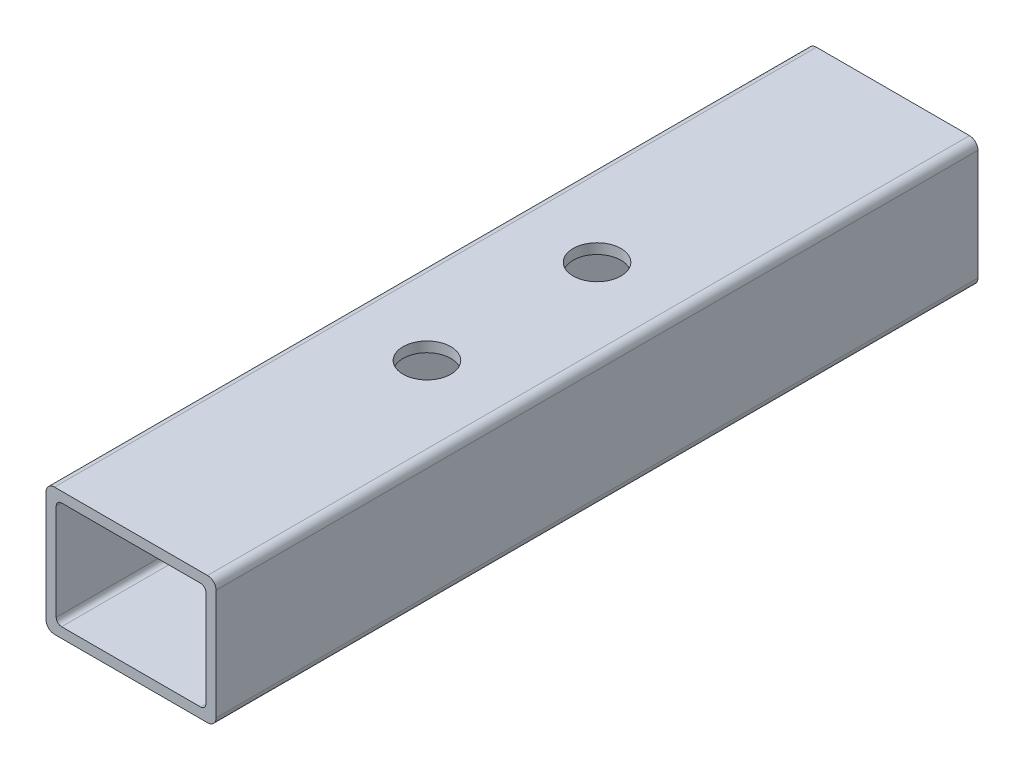
ISO-10303-21;
HEADER;
FILE_DESCRIPTION(('STEP AP214'),'2;1');
FILE_NAME('part.step','',(''),(''),'','','');
FILE_SCHEMA(('AUTOMOTIVE_DESIGN { 1 0 10303 214 1 1 1 1 }'));
ENDSEC;
DATA;
#1=APPLICATION_CONTEXT('core data for automotive mechanical design processes');
#2=APPLICATION_PROTOCOL_DEFINITION('international standard','automotive_design',2000,#1);
#3=PRODUCT_CONTEXT('',#1,'mechanical');
#4=PRODUCT('Part','Part','',(#3));
#5=PRODUCT_RELATED_PRODUCT_CATEGORY('part','',(#4));
#6=PRODUCT_DEFINITION_FORMATION('','',#4);
#7=PRODUCT_DEFINITION_CONTEXT('part definition',#1,'design');
#8=PRODUCT_DEFINITION('design','',#6,#7);
#9=PRODUCT_DEFINITION_SHAPE('','',#8);
#10=(LENGTH_UNIT() NAMED_UNIT(*) SI_UNIT(.MILLI.,.METRE.));
#11=(NAMED_UNIT(*) PLANE_ANGLE_UNIT() SI_UNIT($,.RADIAN.));
#12=(NAMED_UNIT(*) SI_UNIT($,.STERADIAN.) SOLID_ANGLE_UNIT());
#13=UNCERTAINTY_MEASURE_WITH_UNIT(LENGTH_MEASURE(1.E-05),#10,'distance_accuracy_value','');
#14=(GEOMETRIC_REPRESENTATION_CONTEXT(3) GLOBAL_UNCERTAINTY_ASSIGNED_CONTEXT((#13)) GLOBAL_UNIT_ASSIGNED_CONTEXT((#10,
#11,#12)) REPRESENTATION_CONTEXT('',''));
#15=CARTESIAN_POINT('',(0.,0.,0.));
#16=DIRECTION('',(0.,0.,1.));
#17=DIRECTION('',(1.,0.,0.));
#18=AXIS2_PLACEMENT_3D('',#15,#16,#17);
#19=CARTESIAN_POINT('',(22.86,-16.51,227.56368));
#20=DIRECTION('',(0.,0.,1.));
#21=DIRECTION('',(1.,0.,0.));
#22=AXIS2_PLACEMENT_3D('',#19,#20,#21);
#23=PLANE('',#22);
#24=CARTESIAN_POINT('',(22.86,-16.51,227.56368));
#25=DIRECTION('',(0.,0.,1.));
#26=DIRECTION('',(1.,0.,0.));
#27=AXIS2_PLACEMENT_3D('',#24,#25,#26);
#28=CIRCLE('',#27,2.53999999999999);
#29=CARTESIAN_POINT('',(22.86,-19.05,227.56368));
#30=VERTEX_POINT('',#29);
#31=CARTESIAN_POINT('',(25.4,-16.51,227.56368));
#32=VERTEX_POINT('',#31);
#33=EDGE_CURVE('E246',#30,#32,#28,.T.);
#34=ORIENTED_EDGE('',*,*,#33,.T.);
#35=DIRECTION('',(0.,1.,0.));
#36=VECTOR('',#35,1.);
#37=CARTESIAN_POINT('',(25.4,-16.51,227.56368));
#38=LINE('',#37,#36);
#39=CARTESIAN_POINT('',(25.4,16.51,227.56368));
#40=VERTEX_POINT('',#39);
#41=EDGE_CURVE('E250',#32,#40,#38,.T.);
#42=ORIENTED_EDGE('',*,*,#41,.T.);
#43=CARTESIAN_POINT('',(22.86,16.51,227.56368));
#44=DIRECTION('',(0.,0.,1.));
#45=DIRECTION('',(1.,0.,0.));
#46=AXIS2_PLACEMENT_3D('',#43,#44,#45);
#47=CIRCLE('',#46,2.54);
#48=CARTESIAN_POINT('',(22.86,19.05,227.56368));
#49=VERTEX_POINT('',#48);
#50=EDGE_CURVE('E254',#40,#49,#47,.T.);
#51=ORIENTED_EDGE('',*,*,#50,.T.);
#52=DIRECTION('',(-1.,0.,0.));
#53=VECTOR('',#52,1.);
#54=CARTESIAN_POINT('',(22.86,19.05,227.56368));
#55=LINE('',#54,#53);
#56=CARTESIAN_POINT('',(-22.86,19.05,227.56368));
#57=VERTEX_POINT('',#56);
#58=EDGE_CURVE('E257',#49,#57,#55,.T.);
#59=ORIENTED_EDGE('',*,*,#58,.T.);
#60=CARTESIAN_POINT('',(-22.86,16.51,227.56368));
#61=DIRECTION('',(0.,0.,1.));
#62=DIRECTION('',(1.,0.,0.));
#63=AXIS2_PLACEMENT_3D('',#60,#61,#62);
#64=CIRCLE('',#63,2.54);
#65=CARTESIAN_POINT('',(-25.4,16.51,227.56368));
#66=VERTEX_POINT('',#65);
#67=EDGE_CURVE('E260',#57,#66,#64,.T.);
#68=ORIENTED_EDGE('',*,*,#67,.T.);
#69=DIRECTION('',(0.,-1.,0.));
#70=VECTOR('',#69,1.);
#71=CARTESIAN_POINT('',(-25.4,-16.51,227.56368));
#72=LINE('',#71,#70);
#73=CARTESIAN_POINT('',(-25.4,-16.51,227.56368));
#74=VERTEX_POINT('',#73);
#75=EDGE_CURVE('E263',#66,#74,#72,.T.);
#76=ORIENTED_EDGE('',*,*,#75,.T.);
#77=CARTESIAN_POINT('',(-22.86,-16.51,227.56368));
#78=DIRECTION('',(0.,0.,1.));
#79=DIRECTION('',(1.,0.,0.));
#80=AXIS2_PLACEMENT_3D('',#77,#78,#79);
#81=CIRCLE('',#80,2.54);
#82=CARTESIAN_POINT('',(-22.86,-19.05,227.56368));
#83=VERTEX_POINT('',#82);
#84=EDGE_CURVE('E266',#74,#83,#81,.T.);
#85=ORIENTED_EDGE('',*,*,#84,.T.);
#86=DIRECTION('',(1.,0.,0.));
#87=VECTOR('',#86,1.);
#88=CARTESIAN_POINT('',(22.86,-19.05,227.56368));
#89=LINE('',#88,#87);
#90=EDGE_CURVE('E269',#83,#30,#89,.T.);
#91=ORIENTED_EDGE('',*,*,#90,.T.);
#92=EDGE_LOOP('',(#34,#42,#51,#59,#68,#76,#85,#91));
#93=FACE_BOUND('',#92,.T.);
#94=DIRECTION('',(-1.,0.,0.));
#95=VECTOR('',#94,1.);
#96=CARTESIAN_POINT('',(20.7518,16.002,227.56368));
#97=LINE('',#96,#95);
#98=CARTESIAN_POINT('',(20.7518,16.002,227.56368));
#99=VERTEX_POINT('',#98);
#100=CARTESIAN_POINT('',(-20.7518,16.002,227.56368));
#101=VERTEX_POINT('',#100);
#102=EDGE_CURVE('E164',#99,#101,#97,.T.);
#103=ORIENTED_EDGE('',*,*,#102,.F.);
#104=CARTESIAN_POINT('',(20.7518,14.4018,227.56368));
#105=DIRECTION('',(0.,0.,1.));
#106=DIRECTION('',(1.,0.,0.));
#107=AXIS2_PLACEMENT_3D('',#104,#105,#106);
#108=CIRCLE('',#107,1.6002);
#109=CARTESIAN_POINT('',(22.352,14.4018,227.56368));
#110=VERTEX_POINT('',#109);
#111=EDGE_CURVE('E155',#110,#99,#108,.T.);
#112=ORIENTED_EDGE('',*,*,#111,.F.);
#113=DIRECTION('',(0.,1.,0.));
#114=VECTOR('',#113,1.);
#115=CARTESIAN_POINT('',(22.352,14.4018,227.56368));
#116=LINE('',#115,#114);
#117=CARTESIAN_POINT('',(22.352,-14.4018,227.56368));
#118=VERTEX_POINT('',#117);
#119=EDGE_CURVE('E197',#118,#110,#116,.T.);
#120=ORIENTED_EDGE('',*,*,#119,.F.);
#121=CARTESIAN_POINT('',(20.7518,-14.4018,227.56368));
#122=DIRECTION('',(0.,0.,1.));
#123=DIRECTION('',(1.,0.,0.));
#124=AXIS2_PLACEMENT_3D('',#121,#122,#123);
#125=CIRCLE('',#124,1.6002);
#126=CARTESIAN_POINT('',(20.7518,-16.002,227.56368));
#127=VERTEX_POINT('',#126);
#128=EDGE_CURVE('E194',#127,#118,#125,.T.);
#129=ORIENTED_EDGE('',*,*,#128,.F.);
#130=DIRECTION('',(1.,0.,0.));
#131=VECTOR('',#130,1.);
#132=CARTESIAN_POINT('',(20.7518,-16.002,227.56368));
#133=LINE('',#132,#131);
#134=CARTESIAN_POINT('',(-20.7518,-16.002,227.56368));
#135=VERTEX_POINT('',#134);
#136=EDGE_CURVE('E191',#135,#127,#133,.T.);
#137=ORIENTED_EDGE('',*,*,#136,.F.);
#138=CARTESIAN_POINT('',(-20.7518,-14.4018,227.56368));
#139=DIRECTION('',(0.,0.,1.));
#140=DIRECTION('',(1.,0.,0.));
#141=AXIS2_PLACEMENT_3D('',#138,#139,#140);
#142=CIRCLE('',#141,1.6002);
#143=CARTESIAN_POINT('',(-22.352,-14.4018,227.56368));
#144=VERTEX_POINT('',#143);
#145=EDGE_CURVE('E188',#144,#135,#142,.T.);
#146=ORIENTED_EDGE('',*,*,#145,.F.);
#147=DIRECTION('',(0.,-1.,0.));
#148=VECTOR('',#147,1.);
#149=CARTESIAN_POINT('',(-22.352,14.4018,227.56368));
#150=LINE('',#149,#148);
#151=CARTESIAN_POINT('',(-22.352,14.4018,227.56368));
#152=VERTEX_POINT('',#151);
#153=EDGE_CURVE('E182',#152,#144,#150,.T.);
#154=ORIENTED_EDGE('',*,*,#153,.F.);
#155=CARTESIAN_POINT('',(-20.7518,14.4018,227.56368));
#156=DIRECTION('',(0.,0.,1.));
#157=DIRECTION('',(1.,0.,0.));
#158=AXIS2_PLACEMENT_3D('',#155,#156,#157);
#159=CIRCLE('',#158,1.6002);
#160=EDGE_CURVE('E178',#101,#152,#159,.T.);
#161=ORIENTED_EDGE('',*,*,#160,.F.);
#162=EDGE_LOOP('',(#103,#112,#120,#129,#137,#146,#154,#161));
#163=FACE_BOUND('',#162,.T.);
#164=ADVANCED_FACE('F41',(#93,#163),#23,.T.);
#165=CARTESIAN_POINT('',(22.86,-16.51,0.));
#166=DIRECTION('',(0.,0.,1.));
#167=DIRECTION('',(1.,0.,0.));
#168=AXIS2_PLACEMENT_3D('',#165,#166,#167);
#169=PLANE('',#168);
#170=CARTESIAN_POINT('',(22.86,-16.51,0.));
#171=DIRECTION('',(0.,0.,1.));
#172=DIRECTION('',(1.,0.,0.));
#173=AXIS2_PLACEMENT_3D('',#170,#171,#172);
#174=CIRCLE('',#173,2.53999999999999);
#175=CARTESIAN_POINT('',(22.86,-19.05,0.));
#176=VERTEX_POINT('',#175);
#177=CARTESIAN_POINT('',(25.4,-16.51,0.));
#178=VERTEX_POINT('',#177);
#179=EDGE_CURVE('E173',#176,#178,#174,.T.);
#180=ORIENTED_EDGE('',*,*,#179,.F.);
#181=DIRECTION('',(1.,0.,0.));
#182=VECTOR('',#181,1.);
#183=CARTESIAN_POINT('',(22.86,-19.05,0.));
#184=LINE('',#183,#182);
#185=CARTESIAN_POINT('',(-22.86,-19.05,0.));
#186=VERTEX_POINT('',#185);
#187=EDGE_CURVE('E251',#186,#176,#184,.T.);
#188=ORIENTED_EDGE('',*,*,#187,.F.);
#189=CARTESIAN_POINT('',(-22.86,-16.51,0.));
#190=DIRECTION('',(0.,0.,1.));
#191=DIRECTION('',(1.,0.,0.));
#192=AXIS2_PLACEMENT_3D('',#189,#190,#191);
#193=CIRCLE('',#192,2.54);
#194=CARTESIAN_POINT('',(-25.4,-16.51,0.));
#195=VERTEX_POINT('',#194);
#196=EDGE_CURVE('E291',#195,#186,#193,.T.);
#197=ORIENTED_EDGE('',*,*,#196,.F.);
#198=DIRECTION('',(0.,-1.,0.));
#199=VECTOR('',#198,1.);
#200=CARTESIAN_POINT('',(-25.4,-16.51,0.));
#201=LINE('',#200,#199);
#202=CARTESIAN_POINT('',(-25.4,16.51,0.));
#203=VERTEX_POINT('',#202);
#204=EDGE_CURVE('E288',#203,#195,#201,.T.);
#205=ORIENTED_EDGE('',*,*,#204,.F.);
#206=CARTESIAN_POINT('',(-22.86,16.51,0.));
#207=DIRECTION('',(0.,0.,1.));
#208=DIRECTION('',(1.,0.,0.));
#209=AXIS2_PLACEMENT_3D('',#206,#207,#208);
#210=CIRCLE('',#209,2.54);
#211=CARTESIAN_POINT('',(-22.86,19.05,0.));
#212=VERTEX_POINT('',#211);
#213=EDGE_CURVE('E285',#212,#203,#210,.T.);
#214=ORIENTED_EDGE('',*,*,#213,.F.);
#215=DIRECTION('',(-1.,0.,0.));
#216=VECTOR('',#215,1.);
#217=CARTESIAN_POINT('',(22.86,19.05,0.));
#218=LINE('',#217,#216);
#219=CARTESIAN_POINT('',(22.86,19.05,0.));
#220=VERTEX_POINT('',#219);
#221=EDGE_CURVE('E282',#220,#212,#218,.T.);
#222=ORIENTED_EDGE('',*,*,#221,.F.);
#223=CARTESIAN_POINT('',(22.86,16.51,0.));
#224=DIRECTION('',(0.,0.,1.));
#225=DIRECTION('',(1.,0.,0.));
#226=AXIS2_PLACEMENT_3D('',#223,#224,#225);
#227=CIRCLE('',#226,2.54);
#228=CARTESIAN_POINT('',(25.4,16.51,0.));
#229=VERTEX_POINT('',#228);
#230=EDGE_CURVE('E279',#229,#220,#227,.T.);
#231=ORIENTED_EDGE('',*,*,#230,.F.);
#232=DIRECTION('',(0.,1.,0.));
#233=VECTOR('',#232,1.);
#234=CARTESIAN_POINT('',(25.4,-16.51,0.));
#235=LINE('',#234,#233);
#236=EDGE_CURVE('E276',#178,#229,#235,.T.);
#237=ORIENTED_EDGE('',*,*,#236,.F.);
#238=EDGE_LOOP('',(#180,#188,#197,#205,#214,#222,#231,#237));
#239=FACE_BOUND('',#238,.T.);
#240=CARTESIAN_POINT('',(20.7518,14.4018,0.));
#241=DIRECTION('',(0.,0.,1.));
#242=DIRECTION('',(1.,0.,0.));
#243=AXIS2_PLACEMENT_3D('',#240,#241,#242);
#244=CIRCLE('',#243,1.6002);
#245=CARTESIAN_POINT('',(22.352,14.4018,0.));
#246=VERTEX_POINT('',#245);
#247=CARTESIAN_POINT('',(20.7518,16.002,0.));
#248=VERTEX_POINT('',#247);
#249=EDGE_CURVE('E65',#246,#248,#244,.T.);
#250=ORIENTED_EDGE('',*,*,#249,.T.);
#251=DIRECTION('',(-1.,0.,0.));
#252=VECTOR('',#251,1.);
#253=CARTESIAN_POINT('',(20.7518,16.002,0.));
#254=LINE('',#253,#252);
#255=CARTESIAN_POINT('',(-20.7518,16.002,0.));
#256=VERTEX_POINT('',#255);
#257=EDGE_CURVE('E171',#248,#256,#254,.T.);
#258=ORIENTED_EDGE('',*,*,#257,.T.);
#259=CARTESIAN_POINT('',(-20.7518,14.4018,0.));
#260=DIRECTION('',(0.,0.,1.));
#261=DIRECTION('',(1.,0.,0.));
#262=AXIS2_PLACEMENT_3D('',#259,#260,#261);
#263=CIRCLE('',#262,1.6002);
#264=CARTESIAN_POINT('',(-22.352,14.4018,0.));
#265=VERTEX_POINT('',#264);
#266=EDGE_CURVE('E205',#256,#265,#263,.T.);
#267=ORIENTED_EDGE('',*,*,#266,.T.);
#268=DIRECTION('',(0.,-1.,0.));
#269=VECTOR('',#268,1.);
#270=CARTESIAN_POINT('',(-22.352,14.4018,0.));
#271=LINE('',#270,#269);
#272=CARTESIAN_POINT('',(-22.352,-14.4018,0.));
#273=VERTEX_POINT('',#272);
#274=EDGE_CURVE('E209',#265,#273,#271,.T.);
#275=ORIENTED_EDGE('',*,*,#274,.T.);
#276=CARTESIAN_POINT('',(-20.7518,-14.4018,0.));
#277=DIRECTION('',(0.,0.,1.));
#278=DIRECTION('',(1.,0.,0.));
#279=AXIS2_PLACEMENT_3D('',#276,#277,#278);
#280=CIRCLE('',#279,1.6002);
#281=CARTESIAN_POINT('',(-20.7518,-16.002,0.));
#282=VERTEX_POINT('',#281);
#283=EDGE_CURVE('E213',#273,#282,#280,.T.);
#284=ORIENTED_EDGE('',*,*,#283,.T.);
#285=DIRECTION('',(1.,0.,0.));
#286=VECTOR('',#285,1.);
#287=CARTESIAN_POINT('',(20.7518,-16.002,0.));
#288=LINE('',#287,#286);
#289=CARTESIAN_POINT('',(20.7518,-16.002,0.));
#290=VERTEX_POINT('',#289);
#291=EDGE_CURVE('E217',#282,#290,#288,.T.);
#292=ORIENTED_EDGE('',*,*,#291,.T.);
#293=CARTESIAN_POINT('',(20.7518,-14.4018,0.));
#294=DIRECTION('',(0.,0.,1.));
#295=DIRECTION('',(1.,0.,0.));
#296=AXIS2_PLACEMENT_3D('',#293,#294,#295);
#297=CIRCLE('',#296,1.6002);
#298=CARTESIAN_POINT('',(22.352,-14.4018,0.));
#299=VERTEX_POINT('',#298);
#300=EDGE_CURVE('E221',#290,#299,#297,.T.);
#301=ORIENTED_EDGE('',*,*,#300,.T.);
#302=DIRECTION('',(0.,1.,0.));
#303=VECTOR('',#302,1.);
#304=CARTESIAN_POINT('',(22.352,14.4018,0.));
#305=LINE('',#304,#303);
#306=EDGE_CURVE('E165',#299,#246,#305,.T.);
#307=ORIENTED_EDGE('',*,*,#306,.T.);
#308=EDGE_LOOP('',(#250,#258,#267,#275,#284,#292,#301,#307));
#309=FACE_BOUND('',#308,.T.);
#310=ADVANCED_FACE('F330',(#239,#309),#169,.F.);
#311=CARTESIAN_POINT('',(22.86,-16.51,227.56368));
#312=DIRECTION('',(0.,0.,-1.));
#313=DIRECTION('',(-1.,0.,0.));
#314=AXIS2_PLACEMENT_3D('',#311,#312,#313);
#315=CYLINDRICAL_SURFACE('',#314,2.53999999999999);
#316=ORIENTED_EDGE('',*,*,#179,.T.);
#317=DIRECTION('',(0.,0.,-1.));
#318=VECTOR('',#317,1.);
#319=CARTESIAN_POINT('',(25.4,-16.51,227.56368));
#320=LINE('',#319,#318);
#321=EDGE_CURVE('E11',#32,#178,#320,.T.);
#322=ORIENTED_EDGE('',*,*,#321,.F.);
#323=ORIENTED_EDGE('',*,*,#33,.F.);
#324=DIRECTION('',(0.,0.,-1.));
#325=VECTOR('',#324,1.);
#326=CARTESIAN_POINT('',(22.86,-19.05,227.56368));
#327=LINE('',#326,#325);
#328=EDGE_CURVE('E272',#30,#176,#327,.T.);
#329=ORIENTED_EDGE('',*,*,#328,.T.);
#330=EDGE_LOOP('',(#316,#322,#323,#329));
#331=FACE_BOUND('',#330,.T.);
#332=ADVANCED_FACE('F43',(#331),#315,.T.);
#333=CARTESIAN_POINT('',(25.4,-16.51,227.56368));
#334=DIRECTION('',(-1.,0.,0.));
#335=DIRECTION('',(0.,0.,1.));
#336=AXIS2_PLACEMENT_3D('',#333,#334,#335);
#337=PLANE('',#336);
#338=ORIENTED_EDGE('',*,*,#236,.T.);
#339=DIRECTION('',(0.,0.,-1.));
#340=VECTOR('',#339,1.);
#341=CARTESIAN_POINT('',(25.4,16.51,227.56368));
#342=LINE('',#341,#340);
#343=EDGE_CURVE('E50',#40,#229,#342,.T.);
#344=ORIENTED_EDGE('',*,*,#343,.F.);
#345=ORIENTED_EDGE('',*,*,#41,.F.);
#346=ORIENTED_EDGE('',*,*,#321,.T.);
#347=EDGE_LOOP('',(#338,#344,#345,#346));
#348=FACE_BOUND('',#347,.T.);
#349=ADVANCED_FACE('F347',(#348),#337,.F.);
#350=CARTESIAN_POINT('',(22.86,16.51,227.56368));
#351=DIRECTION('',(0.,0.,-1.));
#352=DIRECTION('',(-1.,0.,0.));
#353=AXIS2_PLACEMENT_3D('',#350,#351,#352);
#354=CYLINDRICAL_SURFACE('',#353,2.54);
#355=ORIENTED_EDGE('',*,*,#230,.T.);
#356=DIRECTION('',(0.,0.,-1.));
#357=VECTOR('',#356,1.);
#358=CARTESIAN_POINT('',(22.86,19.05,227.56368));
#359=LINE('',#358,#357);
#360=EDGE_CURVE('E315',#49,#220,#359,.T.);
#361=ORIENTED_EDGE('',*,*,#360,.F.);
#362=ORIENTED_EDGE('',*,*,#50,.F.);
#363=ORIENTED_EDGE('',*,*,#343,.T.);
#364=EDGE_LOOP('',(#355,#361,#362,#363));
#365=FACE_BOUND('',#364,.T.);
#366=ADVANCED_FACE('F324',(#365),#354,.T.);
#367=CARTESIAN_POINT('',(22.86,19.05,227.56368));
#368=DIRECTION('',(0.,-1.,0.));
#369=DIRECTION('',(0.,0.,-1.));
#370=AXIS2_PLACEMENT_3D('',#367,#368,#369);
#371=PLANE('',#370);
#372=CARTESIAN_POINT('',(0.,19.05,139.18184));
#373=DIRECTION('',(0.,1.,0.));
#374=DIRECTION('',(0.,0.,1.));
#375=AXIS2_PLACEMENT_3D('',#372,#373,#374);
#376=CIRCLE('',#375,7.14375);
#377=CARTESIAN_POINT('',(0.,19.05,146.32559));
#378=VERTEX_POINT('',#377);
#379=EDGE_CURVE('E202',#378,#378,#376,.T.);
#380=ORIENTED_EDGE('',*,*,#379,.F.);
#381=EDGE_LOOP('',(#380));
#382=FACE_BOUND('',#381,.T.);
#383=CARTESIAN_POINT('',(0.,19.05,88.38184));
#384=DIRECTION('',(0.,1.,0.));
#385=DIRECTION('',(0.,0.,1.));
#386=AXIS2_PLACEMENT_3D('',#383,#384,#385);
#387=CIRCLE('',#386,7.14375);
#388=CARTESIAN_POINT('',(0.,19.05,95.52559));
#389=VERTEX_POINT('',#388);
#390=EDGE_CURVE('E432',#389,#389,#387,.T.);
#391=ORIENTED_EDGE('',*,*,#390,.F.);
#392=EDGE_LOOP('',(#391));
#393=FACE_BOUND('',#392,.T.);
#394=ORIENTED_EDGE('',*,*,#221,.T.);
#395=DIRECTION('',(0.,0.,-1.));
#396=VECTOR('',#395,1.);
#397=CARTESIAN_POINT('',(-22.86,19.05,227.56368));
#398=LINE('',#397,#396);
#399=EDGE_CURVE('E311',#57,#212,#398,.T.);
#400=ORIENTED_EDGE('',*,*,#399,.F.);
#401=ORIENTED_EDGE('',*,*,#58,.F.);
#402=ORIENTED_EDGE('',*,*,#360,.T.);
#403=EDGE_LOOP('',(#394,#400,#401,#402));
#404=FACE_BOUND('',#403,.T.);
#405=ADVANCED_FACE('F336',(#382,#393,#404),#371,.F.);
#406=CARTESIAN_POINT('',(-22.86,16.51,227.56368));
#407=DIRECTION('',(0.,0.,-1.));
#408=DIRECTION('',(-1.,0.,0.));
#409=AXIS2_PLACEMENT_3D('',#406,#407,#408);
#410=CYLINDRICAL_SURFACE('',#409,2.54);
#411=ORIENTED_EDGE('',*,*,#213,.T.);
#412=DIRECTION('',(0.,0.,-1.));
#413=VECTOR('',#412,1.);
#414=CARTESIAN_POINT('',(-25.4,16.51,227.56368));
#415=LINE('',#414,#413);
#416=EDGE_CURVE('E307',#66,#203,#415,.T.);
#417=ORIENTED_EDGE('',*,*,#416,.F.);
#418=ORIENTED_EDGE('',*,*,#67,.F.);
#419=ORIENTED_EDGE('',*,*,#399,.T.);
#420=EDGE_LOOP('',(#411,#417,#418,#419));
#421=FACE_BOUND('',#420,.T.);
#422=ADVANCED_FACE('F340',(#421),#410,.T.);
#423=CARTESIAN_POINT('',(-25.4,-16.51,227.56368));
#424=DIRECTION('',(1.,0.,0.));
#425=DIRECTION('',(0.,1.,0.));
#426=AXIS2_PLACEMENT_3D('',#423,#424,#425);
#427=PLANE('',#426);
#428=ORIENTED_EDGE('',*,*,#204,.T.);
#429=DIRECTION('',(0.,0.,-1.));
#430=VECTOR('',#429,1.);
#431=CARTESIAN_POINT('',(-25.4,-16.51,227.56368));
#432=LINE('',#431,#430);
#433=EDGE_CURVE('E303',#74,#195,#432,.T.);
#434=ORIENTED_EDGE('',*,*,#433,.F.);
#435=ORIENTED_EDGE('',*,*,#75,.F.);
#436=ORIENTED_EDGE('',*,*,#416,.T.);
#437=EDGE_LOOP('',(#428,#434,#435,#436));
#438=FACE_BOUND('',#437,.T.);
#439=ADVANCED_FACE('F360',(#438),#427,.F.);
#440=CARTESIAN_POINT('',(-22.86,-16.51,227.56368));
#441=DIRECTION('',(0.,0.,-1.));
#442=DIRECTION('',(-1.,0.,0.));
#443=AXIS2_PLACEMENT_3D('',#440,#441,#442);
#444=CYLINDRICAL_SURFACE('',#443,2.54);
#445=ORIENTED_EDGE('',*,*,#196,.T.);
#446=DIRECTION('',(0.,0.,-1.));
#447=VECTOR('',#446,1.);
#448=CARTESIAN_POINT('',(-22.86,-19.05,227.56368));
#449=LINE('',#448,#447);
#450=EDGE_CURVE('E299',#83,#186,#449,.T.);
#451=ORIENTED_EDGE('',*,*,#450,.F.);
#452=ORIENTED_EDGE('',*,*,#84,.F.);
#453=ORIENTED_EDGE('',*,*,#433,.T.);
#454=EDGE_LOOP('',(#445,#451,#452,#453));
#455=FACE_BOUND('',#454,.T.);
#456=ADVANCED_FACE('F358',(#455),#444,.T.);
#457=CARTESIAN_POINT('',(22.86,-19.05,227.56368));
#458=DIRECTION('',(0.,1.,0.));
#459=DIRECTION('',(-1.,0.,0.));
#460=AXIS2_PLACEMENT_3D('',#457,#458,#459);
#461=PLANE('',#460);
#462=ORIENTED_EDGE('',*,*,#187,.T.);
#463=ORIENTED_EDGE('',*,*,#328,.F.);
#464=ORIENTED_EDGE('',*,*,#90,.F.);
#465=ORIENTED_EDGE('',*,*,#450,.T.);
#466=EDGE_LOOP('',(#462,#463,#464,#465));
#467=FACE_BOUND('',#466,.T.);
#468=ADVANCED_FACE('F353',(#467),#461,.F.);
#469=CARTESIAN_POINT('',(20.7518,14.4018,227.56368));
#470=DIRECTION('',(0.,0.,-1.));
#471=DIRECTION('',(-1.,0.,0.));
#472=AXIS2_PLACEMENT_3D('',#469,#470,#471);
#473=CYLINDRICAL_SURFACE('',#472,1.6002);
#474=ORIENTED_EDGE('',*,*,#249,.F.);
#475=DIRECTION('',(0.,0.,-1.));
#476=VECTOR('',#475,1.);
#477=CARTESIAN_POINT('',(22.352,14.4018,227.56368));
#478=LINE('',#477,#476);
#479=EDGE_CURVE('E159',#110,#246,#478,.T.);
#480=ORIENTED_EDGE('',*,*,#479,.F.);
#481=ORIENTED_EDGE('',*,*,#111,.T.);
#482=DIRECTION('',(0.,0.,-1.));
#483=VECTOR('',#482,1.);
#484=CARTESIAN_POINT('',(20.7518,16.002,227.56368));
#485=LINE('',#484,#483);
#486=EDGE_CURVE('E158',#99,#248,#485,.T.);
#487=ORIENTED_EDGE('',*,*,#486,.T.);
#488=EDGE_LOOP('',(#474,#480,#481,#487));
#489=FACE_BOUND('',#488,.T.);
#490=ADVANCED_FACE('F157',(#489),#473,.F.);
#491=CARTESIAN_POINT('',(20.7518,16.002,227.56368));
#492=DIRECTION('',(0.,-1.,0.));
#493=DIRECTION('',(1.,0.,0.));
#494=AXIS2_PLACEMENT_3D('',#491,#492,#493);
#495=PLANE('',#494);
#496=CARTESIAN_POINT('',(0.,16.002,139.18184));
#497=DIRECTION('',(0.,-1.,0.));
#498=DIRECTION('',(1.,0.,0.));
#499=AXIS2_PLACEMENT_3D('',#496,#497,#498);
#500=CIRCLE('',#499,7.14375);
#501=CARTESIAN_POINT('',(7.14375,16.002,139.18184));
#502=VERTEX_POINT('',#501);
#503=EDGE_CURVE('E425',#502,#502,#500,.F.);
#504=ORIENTED_EDGE('',*,*,#503,.T.);
#505=EDGE_LOOP('',(#504));
#506=FACE_BOUND('',#505,.T.);
#507=CARTESIAN_POINT('',(0.,16.002,88.38184));
#508=DIRECTION('',(0.,-1.,0.));
#509=DIRECTION('',(1.,0.,0.));
#510=AXIS2_PLACEMENT_3D('',#507,#508,#509);
#511=CIRCLE('',#510,7.14375);
#512=CARTESIAN_POINT('',(7.14375,16.002,88.38184));
#513=VERTEX_POINT('',#512);
#514=EDGE_CURVE('E435',#513,#513,#511,.F.);
#515=ORIENTED_EDGE('',*,*,#514,.T.);
#516=EDGE_LOOP('',(#515));
#517=FACE_BOUND('',#516,.T.);
#518=ORIENTED_EDGE('',*,*,#257,.F.);
#519=ORIENTED_EDGE('',*,*,#486,.F.);
#520=ORIENTED_EDGE('',*,*,#102,.T.);
#521=DIRECTION('',(0.,0.,-1.));
#522=VECTOR('',#521,1.);
#523=CARTESIAN_POINT('',(-20.7518,16.002,227.56368));
#524=LINE('',#523,#522);
#525=EDGE_CURVE('E174',#101,#256,#524,.T.);
#526=ORIENTED_EDGE('',*,*,#525,.T.);
#527=EDGE_LOOP('',(#518,#519,#520,#526));
#528=FACE_BOUND('',#527,.T.);
#529=ADVANCED_FACE('F168',(#506,#517,#528),#495,.T.);
#530=CARTESIAN_POINT('',(-20.7518,14.4018,227.56368));
#531=DIRECTION('',(0.,0.,-1.));
#532=DIRECTION('',(-1.,0.,0.));
#533=AXIS2_PLACEMENT_3D('',#530,#531,#532);
#534=CYLINDRICAL_SURFACE('',#533,1.6002);
#535=ORIENTED_EDGE('',*,*,#266,.F.);
#536=ORIENTED_EDGE('',*,*,#525,.F.);
#537=ORIENTED_EDGE('',*,*,#160,.T.);
#538=DIRECTION('',(0.,0.,-1.));
#539=VECTOR('',#538,1.);
#540=CARTESIAN_POINT('',(-22.352,14.4018,227.56368));
#541=LINE('',#540,#539);
#542=EDGE_CURVE('E241',#152,#265,#541,.T.);
#543=ORIENTED_EDGE('',*,*,#542,.T.);
#544=EDGE_LOOP('',(#535,#536,#537,#543));
#545=FACE_BOUND('',#544,.T.);
#546=ADVANCED_FACE('F385',(#545),#534,.F.);
#547=CARTESIAN_POINT('',(-22.352,14.4018,227.56368));
#548=DIRECTION('',(1.,0.,0.));
#549=DIRECTION('',(0.,1.,0.));
#550=AXIS2_PLACEMENT_3D('',#547,#548,#549);
#551=PLANE('',#550);
#552=ORIENTED_EDGE('',*,*,#274,.F.);
#553=ORIENTED_EDGE('',*,*,#542,.F.);
#554=ORIENTED_EDGE('',*,*,#153,.T.);
#555=DIRECTION('',(0.,0.,-1.));
#556=VECTOR('',#555,1.);
#557=CARTESIAN_POINT('',(-22.352,-14.4018,227.56368));
#558=LINE('',#557,#556);
#559=EDGE_CURVE('E238',#144,#273,#558,.T.);
#560=ORIENTED_EDGE('',*,*,#559,.T.);
#561=EDGE_LOOP('',(#552,#553,#554,#560));
#562=FACE_BOUND('',#561,.T.);
#563=ADVANCED_FACE('F390',(#562),#551,.T.);
#564=CARTESIAN_POINT('',(-20.7518,-14.4018,227.56368));
#565=DIRECTION('',(0.,0.,-1.));
#566=DIRECTION('',(-1.,0.,0.));
#567=AXIS2_PLACEMENT_3D('',#564,#565,#566);
#568=CYLINDRICAL_SURFACE('',#567,1.6002);
#569=ORIENTED_EDGE('',*,*,#283,.F.);
#570=ORIENTED_EDGE('',*,*,#559,.F.);
#571=ORIENTED_EDGE('',*,*,#145,.T.);
#572=DIRECTION('',(0.,0.,-1.));
#573=VECTOR('',#572,1.);
#574=CARTESIAN_POINT('',(-20.7518,-16.002,227.56368));
#575=LINE('',#574,#573);
#576=EDGE_CURVE('E235',#135,#282,#575,.T.);
#577=ORIENTED_EDGE('',*,*,#576,.T.);
#578=EDGE_LOOP('',(#569,#570,#571,#577));
#579=FACE_BOUND('',#578,.T.);
#580=ADVANCED_FACE('F398',(#579),#568,.F.);
#581=CARTESIAN_POINT('',(20.7518,-16.002,227.56368));
#582=DIRECTION('',(0.,1.,0.));
#583=DIRECTION('',(-1.,0.,0.));
#584=AXIS2_PLACEMENT_3D('',#581,#582,#583);
#585=PLANE('',#584);
#586=ORIENTED_EDGE('',*,*,#291,.F.);
#587=ORIENTED_EDGE('',*,*,#576,.F.);
#588=ORIENTED_EDGE('',*,*,#136,.T.);
#589=DIRECTION('',(0.,0.,-1.));
#590=VECTOR('',#589,1.);
#591=CARTESIAN_POINT('',(20.7518,-16.002,227.56368));
#592=LINE('',#591,#590);
#593=EDGE_CURVE('E232',#127,#290,#592,.T.);
#594=ORIENTED_EDGE('',*,*,#593,.T.);
#595=EDGE_LOOP('',(#586,#587,#588,#594));
#596=FACE_BOUND('',#595,.T.);
#597=ADVANCED_FACE('F402',(#596),#585,.T.);
#598=CARTESIAN_POINT('',(20.7518,-14.4018,227.56368));
#599=DIRECTION('',(0.,0.,-1.));
#600=DIRECTION('',(-1.,0.,0.));
#601=AXIS2_PLACEMENT_3D('',#598,#599,#600);
#602=CYLINDRICAL_SURFACE('',#601,1.6002);
#603=ORIENTED_EDGE('',*,*,#300,.F.);
#604=ORIENTED_EDGE('',*,*,#593,.F.);
#605=ORIENTED_EDGE('',*,*,#128,.T.);
#606=DIRECTION('',(0.,0.,-1.));
#607=VECTOR('',#606,1.);
#608=CARTESIAN_POINT('',(22.352,-14.4018,227.56368));
#609=LINE('',#608,#607);
#610=EDGE_CURVE('E57',#118,#299,#609,.T.);
#611=ORIENTED_EDGE('',*,*,#610,.T.);
#612=EDGE_LOOP('',(#603,#604,#605,#611));
#613=FACE_BOUND('',#612,.T.);
#614=ADVANCED_FACE('F406',(#613),#602,.F.);
#615=CARTESIAN_POINT('',(22.352,14.4018,227.56368));
#616=DIRECTION('',(-1.,0.,0.));
#617=DIRECTION('',(0.,-1.,0.));
#618=AXIS2_PLACEMENT_3D('',#615,#616,#617);
#619=PLANE('',#618);
#620=ORIENTED_EDGE('',*,*,#306,.F.);
#621=ORIENTED_EDGE('',*,*,#610,.F.);
#622=ORIENTED_EDGE('',*,*,#119,.T.);
#623=ORIENTED_EDGE('',*,*,#479,.T.);
#624=EDGE_LOOP('',(#620,#621,#622,#623));
#625=FACE_BOUND('',#624,.T.);
#626=ADVANCED_FACE('F410',(#625),#619,.T.);
#627=CARTESIAN_POINT('',(0.,-19.051,88.38184));
#628=DIRECTION('',(0.,1.,0.));
#629=DIRECTION('',(-1.,0.,0.));
#630=AXIS2_PLACEMENT_3D('',#627,#628,#629);
#631=CYLINDRICAL_SURFACE('',#630,7.14375);
#632=ORIENTED_EDGE('',*,*,#514,.F.);
#633=EDGE_LOOP('',(#632));
#634=FACE_BOUND('',#633,.T.);
#635=ORIENTED_EDGE('',*,*,#390,.T.);
#636=EDGE_LOOP('',(#635));
#637=FACE_BOUND('',#636,.T.);
#638=ADVANCED_FACE('F414',(#634,#637),#631,.F.);
#639=CARTESIAN_POINT('',(0.,-19.051,139.18184));
#640=DIRECTION('',(0.,1.,0.));
#641=DIRECTION('',(-1.,0.,0.));
#642=AXIS2_PLACEMENT_3D('',#639,#640,#641);
#643=CYLINDRICAL_SURFACE('',#642,7.14375);
#644=ORIENTED_EDGE('',*,*,#503,.F.);
#645=EDGE_LOOP('',(#644));
#646=FACE_BOUND('',#645,.T.);
#647=ORIENTED_EDGE('',*,*,#379,.T.);
#648=EDGE_LOOP('',(#647));
#649=FACE_BOUND('',#648,.T.);
#650=ADVANCED_FACE('F417',(#646,#649),#643,.F.);
#651=CLOSED_SHELL('',(#164,#310,#332,#349,#366,#405,#422,#439,#456,#468,#490,#529,#546,#563,
#580,#597,#614,#626,#638,#650));
#652=MANIFOLD_SOLID_BREP('B2',#651);
#653=ADVANCED_BREP_SHAPE_REPRESENTATION('',(#18,#652),#14);
#654=SHAPE_DEFINITION_REPRESENTATION(#9,#653);
ENDSEC;
END-ISO-10303-21;
